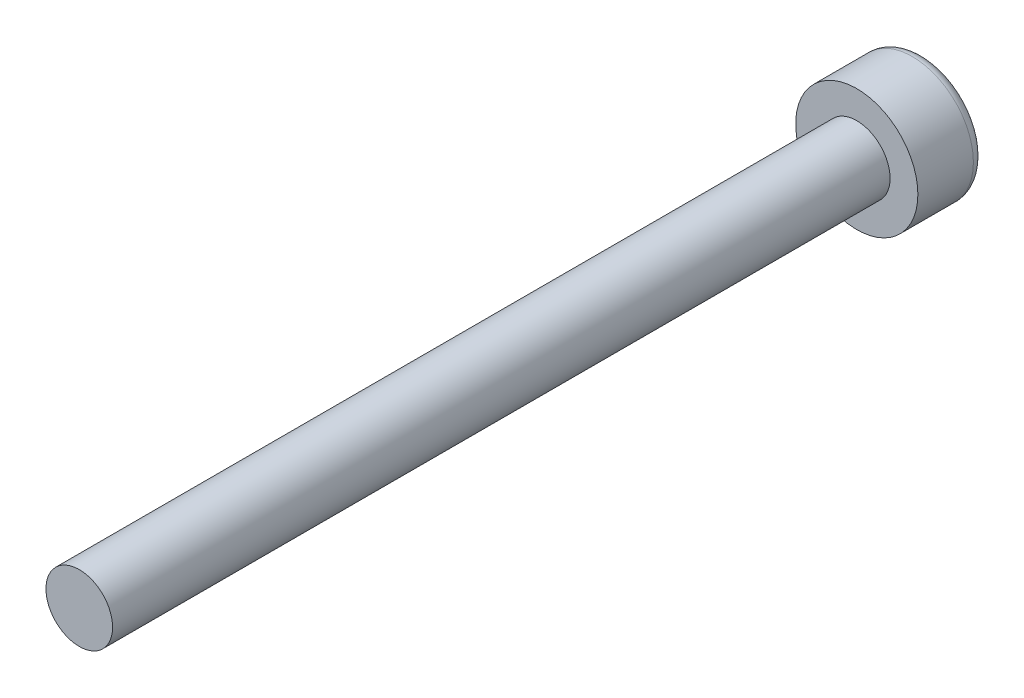
ISO-10303-21;
HEADER;
FILE_DESCRIPTION(('STEP AP214'),'2;1');
FILE_NAME('part.step','',(''),(''),'','','');
FILE_SCHEMA(('AUTOMOTIVE_DESIGN { 1 0 10303 214 1 1 1 1 }'));
ENDSEC;
DATA;
#1=APPLICATION_CONTEXT('core data for automotive mechanical design processes');
#2=APPLICATION_PROTOCOL_DEFINITION('international standard','automotive_design',2000,#1);
#3=PRODUCT_CONTEXT('',#1,'mechanical');
#4=PRODUCT('Part','Part','',(#3));
#5=PRODUCT_RELATED_PRODUCT_CATEGORY('part','',(#4));
#6=PRODUCT_DEFINITION_FORMATION('','',#4);
#7=PRODUCT_DEFINITION_CONTEXT('part definition',#1,'design');
#8=PRODUCT_DEFINITION('design','',#6,#7);
#9=PRODUCT_DEFINITION_SHAPE('','',#8);
#10=(LENGTH_UNIT() NAMED_UNIT(*) SI_UNIT(.MILLI.,.METRE.));
#11=(NAMED_UNIT(*) PLANE_ANGLE_UNIT() SI_UNIT($,.RADIAN.));
#12=(NAMED_UNIT(*) SI_UNIT($,.STERADIAN.) SOLID_ANGLE_UNIT());
#13=UNCERTAINTY_MEASURE_WITH_UNIT(LENGTH_MEASURE(1.E-05),#10,'distance_accuracy_value','');
#14=(GEOMETRIC_REPRESENTATION_CONTEXT(3) GLOBAL_UNCERTAINTY_ASSIGNED_CONTEXT((#13)) GLOBAL_UNIT_ASSIGNED_CONTEXT((#10,
#11,#12)) REPRESENTATION_CONTEXT('',''));
#15=CARTESIAN_POINT('',(0.,0.,0.));
#16=DIRECTION('',(0.,0.,1.));
#17=DIRECTION('',(1.,0.,0.));
#18=AXIS2_PLACEMENT_3D('',#15,#16,#17);
#19=CARTESIAN_POINT('',(0.,0.,3.));
#20=DIRECTION('',(0.,0.,-1.));
#21=DIRECTION('',(-1.,0.,0.));
#22=AXIS2_PLACEMENT_3D('',#19,#20,#21);
#23=CYLINDRICAL_SURFACE('',#22,2.75);
#24=CARTESIAN_POINT('',(0.,0.,0.5));
#25=DIRECTION('',(0.,0.,1.));
#26=DIRECTION('',(1.,0.,0.));
#27=AXIS2_PLACEMENT_3D('',#24,#25,#26);
#28=CIRCLE('',#27,2.75);
#29=CARTESIAN_POINT('',(2.75,0.,0.5));
#30=VERTEX_POINT('',#29);
#31=EDGE_CURVE('E39',#30,#30,#28,.T.);
#32=ORIENTED_EDGE('',*,*,#31,.T.);
#33=EDGE_LOOP('',(#32));
#34=FACE_BOUND('',#33,.T.);
#35=CARTESIAN_POINT('',(0.,0.,3.));
#36=DIRECTION('',(0.,0.,1.));
#37=DIRECTION('',(1.,0.,0.));
#38=AXIS2_PLACEMENT_3D('',#35,#36,#37);
#39=CIRCLE('',#38,2.75);
#40=CARTESIAN_POINT('',(2.75,0.,3.));
#41=VERTEX_POINT('',#40);
#42=EDGE_CURVE('E47',#41,#41,#39,.T.);
#43=ORIENTED_EDGE('',*,*,#42,.F.);
#44=EDGE_LOOP('',(#43));
#45=FACE_BOUND('',#44,.T.);
#46=ADVANCED_FACE('F32',(#34,#45),#23,.T.);
#47=CARTESIAN_POINT('',(0.,0.,3.));
#48=DIRECTION('',(0.,0.,1.));
#49=DIRECTION('',(1.,0.,0.));
#50=AXIS2_PLACEMENT_3D('',#47,#48,#49);
#51=PLANE('',#50);
#52=CARTESIAN_POINT('',(0.,0.,3.));
#53=DIRECTION('',(0.,0.,1.));
#54=DIRECTION('',(1.,0.,0.));
#55=AXIS2_PLACEMENT_3D('',#52,#53,#54);
#56=CIRCLE('',#55,1.5);
#57=CARTESIAN_POINT('',(1.5,0.,3.));
#58=VERTEX_POINT('',#57);
#59=EDGE_CURVE('E43',#58,#58,#56,.T.);
#60=ORIENTED_EDGE('',*,*,#59,.F.);
#61=EDGE_LOOP('',(#60));
#62=FACE_BOUND('',#61,.T.);
#63=ORIENTED_EDGE('',*,*,#42,.T.);
#64=EDGE_LOOP('',(#63));
#65=FACE_BOUND('',#64,.T.);
#66=ADVANCED_FACE('F65',(#62,#65),#51,.T.);
#67=CARTESIAN_POINT('',(0.,0.,0.));
#68=DIRECTION('',(0.,0.,1.));
#69=DIRECTION('',(1.,0.,0.));
#70=AXIS2_PLACEMENT_3D('',#67,#68,#69);
#71=PLANE('',#70);
#72=CARTESIAN_POINT('',(0.,0.,0.));
#73=DIRECTION('',(0.,0.,1.));
#74=DIRECTION('',(1.,0.,0.));
#75=AXIS2_PLACEMENT_3D('',#72,#73,#74);
#76=CIRCLE('',#75,2.25);
#77=CARTESIAN_POINT('',(2.25,0.,0.));
#78=VERTEX_POINT('',#77);
#79=EDGE_CURVE('E10',#78,#78,#76,.F.);
#80=ORIENTED_EDGE('',*,*,#79,.T.);
#81=EDGE_LOOP('',(#80));
#82=FACE_BOUND('',#81,.T.);
#83=ADVANCED_FACE('F61',(#82),#71,.F.);
#84=CARTESIAN_POINT('',(0.,0.,38.));
#85=DIRECTION('',(0.,0.,-1.));
#86=DIRECTION('',(-1.,0.,0.));
#87=AXIS2_PLACEMENT_3D('',#84,#85,#86);
#88=CYLINDRICAL_SURFACE('',#87,1.5);
#89=CARTESIAN_POINT('',(0.,0.,38.));
#90=DIRECTION('',(0.,0.,1.));
#91=DIRECTION('',(1.,0.,0.));
#92=AXIS2_PLACEMENT_3D('',#89,#90,#91);
#93=CIRCLE('',#92,1.5);
#94=CARTESIAN_POINT('',(1.5,0.,38.));
#95=VERTEX_POINT('',#94);
#96=EDGE_CURVE('E51',#95,#95,#93,.T.);
#97=ORIENTED_EDGE('',*,*,#96,.F.);
#98=EDGE_LOOP('',(#97));
#99=FACE_BOUND('',#98,.T.);
#100=ORIENTED_EDGE('',*,*,#59,.T.);
#101=EDGE_LOOP('',(#100));
#102=FACE_BOUND('',#101,.T.);
#103=ADVANCED_FACE('F58',(#99,#102),#88,.T.);
#104=CARTESIAN_POINT('',(0.,0.,38.));
#105=DIRECTION('',(0.,0.,1.));
#106=DIRECTION('',(1.,0.,0.));
#107=AXIS2_PLACEMENT_3D('',#104,#105,#106);
#108=PLANE('',#107);
#109=ORIENTED_EDGE('',*,*,#96,.T.);
#110=EDGE_LOOP('',(#109));
#111=FACE_BOUND('',#110,.T.);
#112=ADVANCED_FACE('F56',(#111),#108,.T.);
#113=CARTESIAN_POINT('',(0.,0.,0.5));
#114=DIRECTION('',(0.,0.,1.));
#115=DIRECTION('',(1.,0.,0.));
#116=AXIS2_PLACEMENT_3D('',#113,#114,#115);
#117=TOROIDAL_SURFACE('',#116,2.25,0.5);
#118=ORIENTED_EDGE('',*,*,#79,.F.);
#119=EDGE_LOOP('',(#118));
#120=FACE_BOUND('',#119,.T.);
#121=ORIENTED_EDGE('',*,*,#31,.F.);
#122=EDGE_LOOP('',(#121));
#123=FACE_BOUND('',#122,.T.);
#124=ADVANCED_FACE('F34',(#120,#123),#117,.T.);
#125=CLOSED_SHELL('',(#46,#66,#83,#103,#112,#124));
#126=MANIFOLD_SOLID_BREP('B2',#125);
#127=ADVANCED_BREP_SHAPE_REPRESENTATION('',(#18,#126),#14);
#128=SHAPE_DEFINITION_REPRESENTATION(#9,#127);
ENDSEC;
END-ISO-10303-21;
